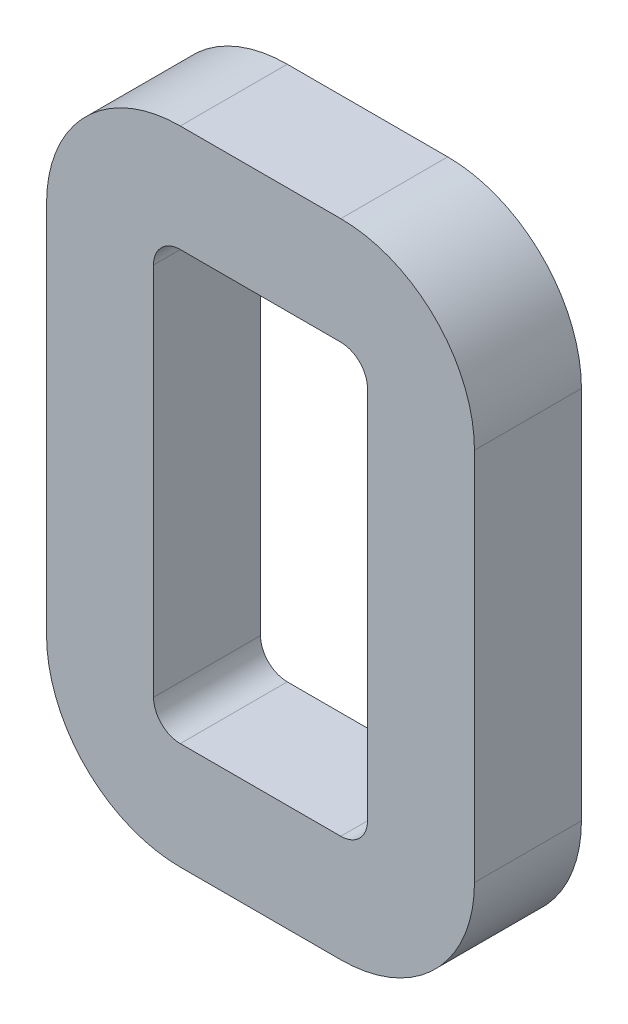
ISO-10303-21;
HEADER;
FILE_DESCRIPTION(('STEP AP214'),'2;1');
FILE_NAME('part.step','',(''),(''),'','','');
FILE_SCHEMA(('AUTOMOTIVE_DESIGN { 1 0 10303 214 1 1 1 1 }'));
ENDSEC;
DATA;
#1=APPLICATION_CONTEXT('core data for automotive mechanical design processes');
#2=APPLICATION_PROTOCOL_DEFINITION('international standard','automotive_design',2000,#1);
#3=PRODUCT_CONTEXT('',#1,'mechanical');
#4=PRODUCT('Part','Part','',(#3));
#5=PRODUCT_RELATED_PRODUCT_CATEGORY('part','',(#4));
#6=PRODUCT_DEFINITION_FORMATION('','',#4);
#7=PRODUCT_DEFINITION_CONTEXT('part definition',#1,'design');
#8=PRODUCT_DEFINITION('design','',#6,#7);
#9=PRODUCT_DEFINITION_SHAPE('','',#8);
#10=(LENGTH_UNIT() NAMED_UNIT(*) SI_UNIT(.MILLI.,.METRE.));
#11=(NAMED_UNIT(*) PLANE_ANGLE_UNIT() SI_UNIT($,.RADIAN.));
#12=(NAMED_UNIT(*) SI_UNIT($,.STERADIAN.) SOLID_ANGLE_UNIT());
#13=UNCERTAINTY_MEASURE_WITH_UNIT(LENGTH_MEASURE(1.E-05),#10,'distance_accuracy_value','');
#14=(GEOMETRIC_REPRESENTATION_CONTEXT(3) GLOBAL_UNCERTAINTY_ASSIGNED_CONTEXT((#13)) GLOBAL_UNIT_ASSIGNED_CONTEXT((#10,
#11,#12)) REPRESENTATION_CONTEXT('',''));
#15=CARTESIAN_POINT('',(0.,0.,0.));
#16=DIRECTION('',(0.,0.,1.));
#17=DIRECTION('',(1.,0.,0.));
#18=AXIS2_PLACEMENT_3D('',#15,#16,#17);
#19=CARTESIAN_POINT('',(3.175,3.175,12.7));
#20=DIRECTION('',(0.,0.,1.));
#21=DIRECTION('',(1.,0.,0.));
#22=AXIS2_PLACEMENT_3D('',#19,#20,#21);
#23=PLANE('',#22);
#24=CARTESIAN_POINT('',(3.175,3.175,12.7));
#25=DIRECTION('',(0.,0.,1.));
#26=DIRECTION('',(1.,0.,0.));
#27=AXIS2_PLACEMENT_3D('',#24,#25,#26);
#28=CIRCLE('',#27,15.875);
#29=CARTESIAN_POINT('',(-12.7,3.17500000000002,12.7));
#30=VERTEX_POINT('',#29);
#31=CARTESIAN_POINT('',(3.17500000000002,-12.7,12.7));
#32=VERTEX_POINT('',#31);
#33=EDGE_CURVE('E246',#30,#32,#28,.T.);
#34=ORIENTED_EDGE('',*,*,#33,.T.);
#35=DIRECTION('',(1.,0.,0.));
#36=VECTOR('',#35,1.);
#37=CARTESIAN_POINT('',(3.17500000000002,-12.7,12.7));
#38=LINE('',#37,#36);
#39=CARTESIAN_POINT('',(22.2249999999999,-12.7,12.7));
#40=VERTEX_POINT('',#39);
#41=EDGE_CURVE('E250',#32,#40,#38,.T.);
#42=ORIENTED_EDGE('',*,*,#41,.T.);
#43=CARTESIAN_POINT('',(22.225,3.175,12.7));
#44=DIRECTION('',(0.,0.,1.));
#45=DIRECTION('',(1.,0.,0.));
#46=AXIS2_PLACEMENT_3D('',#43,#44,#45);
#47=CIRCLE('',#46,15.875);
#48=CARTESIAN_POINT('',(38.1,3.17500000000002,12.7));
#49=VERTEX_POINT('',#48);
#50=EDGE_CURVE('E254',#40,#49,#47,.T.);
#51=ORIENTED_EDGE('',*,*,#50,.T.);
#52=DIRECTION('',(0.,1.,0.));
#53=VECTOR('',#52,1.);
#54=CARTESIAN_POINT('',(38.1,3.17500000000002,12.7));
#55=LINE('',#54,#53);
#56=CARTESIAN_POINT('',(38.1,47.6249999999999,12.7));
#57=VERTEX_POINT('',#56);
#58=EDGE_CURVE('E257',#49,#57,#55,.T.);
#59=ORIENTED_EDGE('',*,*,#58,.T.);
#60=CARTESIAN_POINT('',(22.225,47.625,12.7));
#61=DIRECTION('',(0.,0.,1.));
#62=DIRECTION('',(-1.,0.,0.));
#63=AXIS2_PLACEMENT_3D('',#60,#61,#62);
#64=CIRCLE('',#63,15.875);
#65=CARTESIAN_POINT('',(22.225,63.5,12.7));
#66=VERTEX_POINT('',#65);
#67=EDGE_CURVE('E260',#57,#66,#64,.T.);
#68=ORIENTED_EDGE('',*,*,#67,.T.);
#69=DIRECTION('',(-1.,0.,0.));
#70=VECTOR('',#69,1.);
#71=CARTESIAN_POINT('',(3.17500000000012,63.5,12.7));
#72=LINE('',#71,#70);
#73=CARTESIAN_POINT('',(3.17500000000012,63.5,12.7));
#74=VERTEX_POINT('',#73);
#75=EDGE_CURVE('E263',#66,#74,#72,.T.);
#76=ORIENTED_EDGE('',*,*,#75,.T.);
#77=CARTESIAN_POINT('',(3.175,47.625,12.7));
#78=DIRECTION('',(0.,0.,1.));
#79=DIRECTION('',(1.,0.,0.));
#80=AXIS2_PLACEMENT_3D('',#77,#78,#79);
#81=CIRCLE('',#80,15.875);
#82=CARTESIAN_POINT('',(-12.7,47.625,12.7));
#83=VERTEX_POINT('',#82);
#84=EDGE_CURVE('E266',#74,#83,#81,.T.);
#85=ORIENTED_EDGE('',*,*,#84,.T.);
#86=DIRECTION('',(0.,-1.,0.));
#87=VECTOR('',#86,1.);
#88=CARTESIAN_POINT('',(-12.7,3.17500000000002,12.7));
#89=LINE('',#88,#87);
#90=EDGE_CURVE('E269',#83,#30,#89,.T.);
#91=ORIENTED_EDGE('',*,*,#90,.T.);
#92=EDGE_LOOP('',(#34,#42,#51,#59,#68,#76,#85,#91));
#93=FACE_BOUND('',#92,.T.);
#94=DIRECTION('',(1.,0.,0.));
#95=VECTOR('',#94,1.);
#96=CARTESIAN_POINT('',(3.17500000000002,0.,12.7));
#97=LINE('',#96,#95);
#98=CARTESIAN_POINT('',(3.17500000000002,0.,12.7));
#99=VERTEX_POINT('',#98);
#100=CARTESIAN_POINT('',(22.225,0.,12.7));
#101=VERTEX_POINT('',#100);
#102=EDGE_CURVE('E166',#99,#101,#97,.T.);
#103=ORIENTED_EDGE('',*,*,#102,.F.);
#104=CARTESIAN_POINT('',(3.175,3.175,12.7));
#105=DIRECTION('',(0.,0.,1.));
#106=DIRECTION('',(1.,0.,0.));
#107=AXIS2_PLACEMENT_3D('',#104,#105,#106);
#108=CIRCLE('',#107,3.175);
#109=CARTESIAN_POINT('',(0.,3.17500000000002,12.7));
#110=VERTEX_POINT('',#109);
#111=EDGE_CURVE('E157',#110,#99,#108,.T.);
#112=ORIENTED_EDGE('',*,*,#111,.F.);
#113=DIRECTION('',(0.,-1.,0.));
#114=VECTOR('',#113,1.);
#115=CARTESIAN_POINT('',(0.,3.17500000000002,12.7));
#116=LINE('',#115,#114);
#117=CARTESIAN_POINT('',(0.,47.625,12.7));
#118=VERTEX_POINT('',#117);
#119=EDGE_CURVE('E198',#118,#110,#116,.T.);
#120=ORIENTED_EDGE('',*,*,#119,.F.);
#121=CARTESIAN_POINT('',(3.175,47.625,12.7));
#122=DIRECTION('',(0.,0.,1.));
#123=DIRECTION('',(1.,0.,0.));
#124=AXIS2_PLACEMENT_3D('',#121,#122,#123);
#125=CIRCLE('',#124,3.175);
#126=CARTESIAN_POINT('',(3.17500000000002,50.8,12.7));
#127=VERTEX_POINT('',#126);
#128=EDGE_CURVE('E195',#127,#118,#125,.T.);
#129=ORIENTED_EDGE('',*,*,#128,.F.);
#130=DIRECTION('',(-1.,0.,0.));
#131=VECTOR('',#130,1.);
#132=CARTESIAN_POINT('',(3.17500000000002,50.8,12.7));
#133=LINE('',#132,#131);
#134=CARTESIAN_POINT('',(22.225,50.8,12.7));
#135=VERTEX_POINT('',#134);
#136=EDGE_CURVE('E192',#135,#127,#133,.T.);
#137=ORIENTED_EDGE('',*,*,#136,.F.);
#138=CARTESIAN_POINT('',(22.225,47.625,12.7));
#139=DIRECTION('',(0.,0.,1.));
#140=DIRECTION('',(-1.,0.,0.));
#141=AXIS2_PLACEMENT_3D('',#138,#139,#140);
#142=CIRCLE('',#141,3.175);
#143=CARTESIAN_POINT('',(25.4,47.625,12.7));
#144=VERTEX_POINT('',#143);
#145=EDGE_CURVE('E189',#144,#135,#142,.T.);
#146=ORIENTED_EDGE('',*,*,#145,.F.);
#147=DIRECTION('',(0.,1.,0.));
#148=VECTOR('',#147,1.);
#149=CARTESIAN_POINT('',(25.4,3.17500000000002,12.7));
#150=LINE('',#149,#148);
#151=CARTESIAN_POINT('',(25.4,3.17500000000002,12.7));
#152=VERTEX_POINT('',#151);
#153=EDGE_CURVE('E184',#152,#144,#150,.T.);
#154=ORIENTED_EDGE('',*,*,#153,.F.);
#155=CARTESIAN_POINT('',(22.225,3.175,12.7));
#156=DIRECTION('',(0.,0.,1.));
#157=DIRECTION('',(1.,0.,0.));
#158=AXIS2_PLACEMENT_3D('',#155,#156,#157);
#159=CIRCLE('',#158,3.175);
#160=EDGE_CURVE('E180',#101,#152,#159,.T.);
#161=ORIENTED_EDGE('',*,*,#160,.F.);
#162=EDGE_LOOP('',(#103,#112,#120,#129,#137,#146,#154,#161));
#163=FACE_BOUND('',#162,.T.);
#164=ADVANCED_FACE('F43',(#93,#163),#23,.T.);
#165=CARTESIAN_POINT('',(3.175,3.175,0.));
#166=DIRECTION('',(0.,0.,1.));
#167=DIRECTION('',(1.,0.,0.));
#168=AXIS2_PLACEMENT_3D('',#165,#166,#167);
#169=PLANE('',#168);
#170=CARTESIAN_POINT('',(3.175,3.175,0.));
#171=DIRECTION('',(0.,0.,1.));
#172=DIRECTION('',(1.,0.,0.));
#173=AXIS2_PLACEMENT_3D('',#170,#171,#172);
#174=CIRCLE('',#173,15.875);
#175=CARTESIAN_POINT('',(-12.7,3.17500000000002,0.));
#176=VERTEX_POINT('',#175);
#177=CARTESIAN_POINT('',(3.17500000000002,-12.7,0.));
#178=VERTEX_POINT('',#177);
#179=EDGE_CURVE('E175',#176,#178,#174,.T.);
#180=ORIENTED_EDGE('',*,*,#179,.F.);
#181=DIRECTION('',(0.,-1.,0.));
#182=VECTOR('',#181,1.);
#183=CARTESIAN_POINT('',(-12.7,3.17500000000002,0.));
#184=LINE('',#183,#182);
#185=CARTESIAN_POINT('',(-12.7,47.625,0.));
#186=VERTEX_POINT('',#185);
#187=EDGE_CURVE('E251',#186,#176,#184,.T.);
#188=ORIENTED_EDGE('',*,*,#187,.F.);
#189=CARTESIAN_POINT('',(3.175,47.625,0.));
#190=DIRECTION('',(0.,0.,1.));
#191=DIRECTION('',(1.,0.,0.));
#192=AXIS2_PLACEMENT_3D('',#189,#190,#191);
#193=CIRCLE('',#192,15.875);
#194=CARTESIAN_POINT('',(3.17500000000012,63.5,0.));
#195=VERTEX_POINT('',#194);
#196=EDGE_CURVE('E291',#195,#186,#193,.T.);
#197=ORIENTED_EDGE('',*,*,#196,.F.);
#198=DIRECTION('',(-1.,0.,0.));
#199=VECTOR('',#198,1.);
#200=CARTESIAN_POINT('',(3.17500000000012,63.5,0.));
#201=LINE('',#200,#199);
#202=CARTESIAN_POINT('',(22.225,63.5,0.));
#203=VERTEX_POINT('',#202);
#204=EDGE_CURVE('E288',#203,#195,#201,.T.);
#205=ORIENTED_EDGE('',*,*,#204,.F.);
#206=CARTESIAN_POINT('',(22.225,47.625,0.));
#207=DIRECTION('',(0.,0.,1.));
#208=DIRECTION('',(-1.,0.,0.));
#209=AXIS2_PLACEMENT_3D('',#206,#207,#208);
#210=CIRCLE('',#209,15.875);
#211=CARTESIAN_POINT('',(38.1,47.6249999999999,0.));
#212=VERTEX_POINT('',#211);
#213=EDGE_CURVE('E285',#212,#203,#210,.T.);
#214=ORIENTED_EDGE('',*,*,#213,.F.);
#215=DIRECTION('',(0.,1.,0.));
#216=VECTOR('',#215,1.);
#217=CARTESIAN_POINT('',(38.1,3.17500000000002,0.));
#218=LINE('',#217,#216);
#219=CARTESIAN_POINT('',(38.1,3.17500000000002,0.));
#220=VERTEX_POINT('',#219);
#221=EDGE_CURVE('E282',#220,#212,#218,.T.);
#222=ORIENTED_EDGE('',*,*,#221,.F.);
#223=CARTESIAN_POINT('',(22.225,3.175,0.));
#224=DIRECTION('',(0.,0.,1.));
#225=DIRECTION('',(1.,0.,0.));
#226=AXIS2_PLACEMENT_3D('',#223,#224,#225);
#227=CIRCLE('',#226,15.875);
#228=CARTESIAN_POINT('',(22.2249999999999,-12.7,0.));
#229=VERTEX_POINT('',#228);
#230=EDGE_CURVE('E279',#229,#220,#227,.T.);
#231=ORIENTED_EDGE('',*,*,#230,.F.);
#232=DIRECTION('',(1.,0.,0.));
#233=VECTOR('',#232,1.);
#234=CARTESIAN_POINT('',(3.17500000000002,-12.7,0.));
#235=LINE('',#234,#233);
#236=EDGE_CURVE('E276',#178,#229,#235,.T.);
#237=ORIENTED_EDGE('',*,*,#236,.F.);
#238=EDGE_LOOP('',(#180,#188,#197,#205,#214,#222,#231,#237));
#239=FACE_BOUND('',#238,.T.);
#240=CARTESIAN_POINT('',(3.175,3.175,0.));
#241=DIRECTION('',(0.,0.,1.));
#242=DIRECTION('',(1.,0.,0.));
#243=AXIS2_PLACEMENT_3D('',#240,#241,#242);
#244=CIRCLE('',#243,3.175);
#245=CARTESIAN_POINT('',(0.,3.17500000000002,0.));
#246=VERTEX_POINT('',#245);
#247=CARTESIAN_POINT('',(3.17500000000002,0.,0.));
#248=VERTEX_POINT('',#247);
#249=EDGE_CURVE('E67',#246,#248,#244,.T.);
#250=ORIENTED_EDGE('',*,*,#249,.T.);
#251=DIRECTION('',(1.,0.,0.));
#252=VECTOR('',#251,1.);
#253=CARTESIAN_POINT('',(3.17500000000002,0.,0.));
#254=LINE('',#253,#252);
#255=CARTESIAN_POINT('',(22.225,0.,0.));
#256=VERTEX_POINT('',#255);
#257=EDGE_CURVE('E173',#248,#256,#254,.T.);
#258=ORIENTED_EDGE('',*,*,#257,.T.);
#259=CARTESIAN_POINT('',(22.225,3.175,0.));
#260=DIRECTION('',(0.,0.,1.));
#261=DIRECTION('',(1.,0.,0.));
#262=AXIS2_PLACEMENT_3D('',#259,#260,#261);
#263=CIRCLE('',#262,3.175);
#264=CARTESIAN_POINT('',(25.4,3.17500000000002,0.));
#265=VERTEX_POINT('',#264);
#266=EDGE_CURVE('E205',#256,#265,#263,.T.);
#267=ORIENTED_EDGE('',*,*,#266,.T.);
#268=DIRECTION('',(0.,1.,0.));
#269=VECTOR('',#268,1.);
#270=CARTESIAN_POINT('',(25.4,3.17500000000002,0.));
#271=LINE('',#270,#269);
#272=CARTESIAN_POINT('',(25.4,47.625,0.));
#273=VERTEX_POINT('',#272);
#274=EDGE_CURVE('E209',#265,#273,#271,.T.);
#275=ORIENTED_EDGE('',*,*,#274,.T.);
#276=CARTESIAN_POINT('',(22.225,47.625,0.));
#277=DIRECTION('',(0.,0.,1.));
#278=DIRECTION('',(-1.,0.,0.));
#279=AXIS2_PLACEMENT_3D('',#276,#277,#278);
#280=CIRCLE('',#279,3.175);
#281=CARTESIAN_POINT('',(22.225,50.8,0.));
#282=VERTEX_POINT('',#281);
#283=EDGE_CURVE('E213',#273,#282,#280,.T.);
#284=ORIENTED_EDGE('',*,*,#283,.T.);
#285=DIRECTION('',(-1.,0.,0.));
#286=VECTOR('',#285,1.);
#287=CARTESIAN_POINT('',(3.17500000000002,50.8,0.));
#288=LINE('',#287,#286);
#289=CARTESIAN_POINT('',(3.17500000000002,50.8,0.));
#290=VERTEX_POINT('',#289);
#291=EDGE_CURVE('E217',#282,#290,#288,.T.);
#292=ORIENTED_EDGE('',*,*,#291,.T.);
#293=CARTESIAN_POINT('',(3.175,47.625,0.));
#294=DIRECTION('',(0.,0.,1.));
#295=DIRECTION('',(1.,0.,0.));
#296=AXIS2_PLACEMENT_3D('',#293,#294,#295);
#297=CIRCLE('',#296,3.175);
#298=CARTESIAN_POINT('',(0.,47.625,0.));
#299=VERTEX_POINT('',#298);
#300=EDGE_CURVE('E221',#290,#299,#297,.T.);
#301=ORIENTED_EDGE('',*,*,#300,.T.);
#302=DIRECTION('',(0.,-1.,0.));
#303=VECTOR('',#302,1.);
#304=CARTESIAN_POINT('',(0.,3.17500000000002,0.));
#305=LINE('',#304,#303);
#306=EDGE_CURVE('E167',#299,#246,#305,.T.);
#307=ORIENTED_EDGE('',*,*,#306,.T.);
#308=EDGE_LOOP('',(#250,#258,#267,#275,#284,#292,#301,#307));
#309=FACE_BOUND('',#308,.T.);
#310=ADVANCED_FACE('F330',(#239,#309),#169,.F.);
#311=CARTESIAN_POINT('',(3.175,3.175,12.7));
#312=DIRECTION('',(0.,0.,-1.));
#313=DIRECTION('',(-1.,0.,0.));
#314=AXIS2_PLACEMENT_3D('',#311,#312,#313);
#315=CYLINDRICAL_SURFACE('',#314,15.875);
#316=ORIENTED_EDGE('',*,*,#179,.T.);
#317=DIRECTION('',(0.,0.,-1.));
#318=VECTOR('',#317,1.);
#319=CARTESIAN_POINT('',(3.17500000000002,-12.7,12.7));
#320=LINE('',#319,#318);
#321=EDGE_CURVE('E11',#32,#178,#320,.T.);
#322=ORIENTED_EDGE('',*,*,#321,.F.);
#323=ORIENTED_EDGE('',*,*,#33,.F.);
#324=DIRECTION('',(0.,0.,-1.));
#325=VECTOR('',#324,1.);
#326=CARTESIAN_POINT('',(-12.7,3.17500000000002,12.7));
#327=LINE('',#326,#325);
#328=EDGE_CURVE('E272',#30,#176,#327,.T.);
#329=ORIENTED_EDGE('',*,*,#328,.T.);
#330=EDGE_LOOP('',(#316,#322,#323,#329));
#331=FACE_BOUND('',#330,.T.);
#332=ADVANCED_FACE('F45',(#331),#315,.T.);
#333=CARTESIAN_POINT('',(3.17500000000002,-12.7,12.7));
#334=DIRECTION('',(0.,1.,0.));
#335=DIRECTION('',(-1.,0.,0.));
#336=AXIS2_PLACEMENT_3D('',#333,#334,#335);
#337=PLANE('',#336);
#338=ORIENTED_EDGE('',*,*,#236,.T.);
#339=DIRECTION('',(0.,0.,-1.));
#340=VECTOR('',#339,1.);
#341=CARTESIAN_POINT('',(22.2249999999999,-12.7,12.7));
#342=LINE('',#341,#340);
#343=EDGE_CURVE('E52',#40,#229,#342,.T.);
#344=ORIENTED_EDGE('',*,*,#343,.F.);
#345=ORIENTED_EDGE('',*,*,#41,.F.);
#346=ORIENTED_EDGE('',*,*,#321,.T.);
#347=EDGE_LOOP('',(#338,#344,#345,#346));
#348=FACE_BOUND('',#347,.T.);
#349=ADVANCED_FACE('F347',(#348),#337,.F.);
#350=CARTESIAN_POINT('',(22.225,3.175,12.7));
#351=DIRECTION('',(0.,0.,-1.));
#352=DIRECTION('',(-1.,0.,0.));
#353=AXIS2_PLACEMENT_3D('',#350,#351,#352);
#354=CYLINDRICAL_SURFACE('',#353,15.875);
#355=ORIENTED_EDGE('',*,*,#230,.T.);
#356=DIRECTION('',(0.,0.,-1.));
#357=VECTOR('',#356,1.);
#358=CARTESIAN_POINT('',(38.1,3.17500000000002,12.7));
#359=LINE('',#358,#357);
#360=EDGE_CURVE('E315',#49,#220,#359,.T.);
#361=ORIENTED_EDGE('',*,*,#360,.F.);
#362=ORIENTED_EDGE('',*,*,#50,.F.);
#363=ORIENTED_EDGE('',*,*,#343,.T.);
#364=EDGE_LOOP('',(#355,#361,#362,#363));
#365=FACE_BOUND('',#364,.T.);
#366=ADVANCED_FACE('F324',(#365),#354,.T.);
#367=CARTESIAN_POINT('',(38.1,3.17500000000002,12.7));
#368=DIRECTION('',(-1.,0.,0.));
#369=DIRECTION('',(0.,0.,1.));
#370=AXIS2_PLACEMENT_3D('',#367,#368,#369);
#371=PLANE('',#370);
#372=ORIENTED_EDGE('',*,*,#221,.T.);
#373=DIRECTION('',(0.,0.,-1.));
#374=VECTOR('',#373,1.);
#375=CARTESIAN_POINT('',(38.1,47.6249999999999,12.7));
#376=LINE('',#375,#374);
#377=EDGE_CURVE('E311',#57,#212,#376,.T.);
#378=ORIENTED_EDGE('',*,*,#377,.F.);
#379=ORIENTED_EDGE('',*,*,#58,.F.);
#380=ORIENTED_EDGE('',*,*,#360,.T.);
#381=EDGE_LOOP('',(#372,#378,#379,#380));
#382=FACE_BOUND('',#381,.T.);
#383=ADVANCED_FACE('F336',(#382),#371,.F.);
#384=CARTESIAN_POINT('',(22.225,47.625,12.7));
#385=DIRECTION('',(0.,0.,-1.));
#386=DIRECTION('',(-1.,0.,0.));
#387=AXIS2_PLACEMENT_3D('',#384,#385,#386);
#388=CYLINDRICAL_SURFACE('',#387,15.875);
#389=ORIENTED_EDGE('',*,*,#213,.T.);
#390=DIRECTION('',(0.,0.,-1.));
#391=VECTOR('',#390,1.);
#392=CARTESIAN_POINT('',(22.225,63.5,12.7));
#393=LINE('',#392,#391);
#394=EDGE_CURVE('E307',#66,#203,#393,.T.);
#395=ORIENTED_EDGE('',*,*,#394,.F.);
#396=ORIENTED_EDGE('',*,*,#67,.F.);
#397=ORIENTED_EDGE('',*,*,#377,.T.);
#398=EDGE_LOOP('',(#389,#395,#396,#397));
#399=FACE_BOUND('',#398,.T.);
#400=ADVANCED_FACE('F340',(#399),#388,.T.);
#401=CARTESIAN_POINT('',(3.17500000000012,63.5,12.7));
#402=DIRECTION('',(0.,-1.,0.));
#403=DIRECTION('',(0.,0.,-1.));
#404=AXIS2_PLACEMENT_3D('',#401,#402,#403);
#405=PLANE('',#404);
#406=ORIENTED_EDGE('',*,*,#204,.T.);
#407=DIRECTION('',(0.,0.,-1.));
#408=VECTOR('',#407,1.);
#409=CARTESIAN_POINT('',(3.17500000000012,63.5,12.7));
#410=LINE('',#409,#408);
#411=EDGE_CURVE('E303',#74,#195,#410,.T.);
#412=ORIENTED_EDGE('',*,*,#411,.F.);
#413=ORIENTED_EDGE('',*,*,#75,.F.);
#414=ORIENTED_EDGE('',*,*,#394,.T.);
#415=EDGE_LOOP('',(#406,#412,#413,#414));
#416=FACE_BOUND('',#415,.T.);
#417=ADVANCED_FACE('F360',(#416),#405,.F.);
#418=CARTESIAN_POINT('',(3.175,47.625,12.7));
#419=DIRECTION('',(0.,0.,-1.));
#420=DIRECTION('',(-1.,0.,0.));
#421=AXIS2_PLACEMENT_3D('',#418,#419,#420);
#422=CYLINDRICAL_SURFACE('',#421,15.875);
#423=ORIENTED_EDGE('',*,*,#196,.T.);
#424=DIRECTION('',(0.,0.,-1.));
#425=VECTOR('',#424,1.);
#426=CARTESIAN_POINT('',(-12.7,47.625,12.7));
#427=LINE('',#426,#425);
#428=EDGE_CURVE('E299',#83,#186,#427,.T.);
#429=ORIENTED_EDGE('',*,*,#428,.F.);
#430=ORIENTED_EDGE('',*,*,#84,.F.);
#431=ORIENTED_EDGE('',*,*,#411,.T.);
#432=EDGE_LOOP('',(#423,#429,#430,#431));
#433=FACE_BOUND('',#432,.T.);
#434=ADVANCED_FACE('F358',(#433),#422,.T.);
#435=CARTESIAN_POINT('',(-12.7,3.17500000000002,12.7));
#436=DIRECTION('',(1.,0.,0.));
#437=DIRECTION('',(0.,0.,-1.));
#438=AXIS2_PLACEMENT_3D('',#435,#436,#437);
#439=PLANE('',#438);
#440=ORIENTED_EDGE('',*,*,#187,.T.);
#441=ORIENTED_EDGE('',*,*,#328,.F.);
#442=ORIENTED_EDGE('',*,*,#90,.F.);
#443=ORIENTED_EDGE('',*,*,#428,.T.);
#444=EDGE_LOOP('',(#440,#441,#442,#443));
#445=FACE_BOUND('',#444,.T.);
#446=ADVANCED_FACE('F353',(#445),#439,.F.);
#447=CARTESIAN_POINT('',(3.175,3.175,12.7));
#448=DIRECTION('',(0.,0.,-1.));
#449=DIRECTION('',(-1.,0.,0.));
#450=AXIS2_PLACEMENT_3D('',#447,#448,#449);
#451=CYLINDRICAL_SURFACE('',#450,3.175);
#452=ORIENTED_EDGE('',*,*,#249,.F.);
#453=DIRECTION('',(0.,0.,-1.));
#454=VECTOR('',#453,1.);
#455=CARTESIAN_POINT('',(0.,3.17500000000002,12.7));
#456=LINE('',#455,#454);
#457=EDGE_CURVE('E161',#110,#246,#456,.T.);
#458=ORIENTED_EDGE('',*,*,#457,.F.);
#459=ORIENTED_EDGE('',*,*,#111,.T.);
#460=DIRECTION('',(0.,0.,-1.));
#461=VECTOR('',#460,1.);
#462=CARTESIAN_POINT('',(3.17500000000002,0.,12.7));
#463=LINE('',#462,#461);
#464=EDGE_CURVE('E160',#99,#248,#463,.T.);
#465=ORIENTED_EDGE('',*,*,#464,.T.);
#466=EDGE_LOOP('',(#452,#458,#459,#465));
#467=FACE_BOUND('',#466,.T.);
#468=ADVANCED_FACE('F159',(#467),#451,.F.);
#469=CARTESIAN_POINT('',(3.17500000000002,0.,12.7));
#470=DIRECTION('',(0.,1.,0.));
#471=DIRECTION('',(0.,0.,1.));
#472=AXIS2_PLACEMENT_3D('',#469,#470,#471);
#473=PLANE('',#472);
#474=ORIENTED_EDGE('',*,*,#257,.F.);
#475=ORIENTED_EDGE('',*,*,#464,.F.);
#476=ORIENTED_EDGE('',*,*,#102,.T.);
#477=DIRECTION('',(0.,0.,-1.));
#478=VECTOR('',#477,1.);
#479=CARTESIAN_POINT('',(22.225,0.,12.7));
#480=LINE('',#479,#478);
#481=EDGE_CURVE('E176',#101,#256,#480,.T.);
#482=ORIENTED_EDGE('',*,*,#481,.T.);
#483=EDGE_LOOP('',(#474,#475,#476,#482));
#484=FACE_BOUND('',#483,.T.);
#485=ADVANCED_FACE('F170',(#484),#473,.T.);
#486=CARTESIAN_POINT('',(22.225,3.175,12.7));
#487=DIRECTION('',(0.,0.,-1.));
#488=DIRECTION('',(-1.,0.,0.));
#489=AXIS2_PLACEMENT_3D('',#486,#487,#488);
#490=CYLINDRICAL_SURFACE('',#489,3.175);
#491=ORIENTED_EDGE('',*,*,#266,.F.);
#492=ORIENTED_EDGE('',*,*,#481,.F.);
#493=ORIENTED_EDGE('',*,*,#160,.T.);
#494=DIRECTION('',(0.,0.,-1.));
#495=VECTOR('',#494,1.);
#496=CARTESIAN_POINT('',(25.4,3.17500000000002,12.7));
#497=LINE('',#496,#495);
#498=EDGE_CURVE('E241',#152,#265,#497,.T.);
#499=ORIENTED_EDGE('',*,*,#498,.T.);
#500=EDGE_LOOP('',(#491,#492,#493,#499));
#501=FACE_BOUND('',#500,.T.);
#502=ADVANCED_FACE('F385',(#501),#490,.F.);
#503=CARTESIAN_POINT('',(25.4,3.17500000000002,12.7));
#504=DIRECTION('',(-1.,0.,0.));
#505=DIRECTION('',(0.,0.,1.));
#506=AXIS2_PLACEMENT_3D('',#503,#504,#505);
#507=PLANE('',#506);
#508=ORIENTED_EDGE('',*,*,#274,.F.);
#509=ORIENTED_EDGE('',*,*,#498,.F.);
#510=ORIENTED_EDGE('',*,*,#153,.T.);
#511=DIRECTION('',(0.,0.,-1.));
#512=VECTOR('',#511,1.);
#513=CARTESIAN_POINT('',(25.4,47.625,12.7));
#514=LINE('',#513,#512);
#515=EDGE_CURVE('E238',#144,#273,#514,.T.);
#516=ORIENTED_EDGE('',*,*,#515,.T.);
#517=EDGE_LOOP('',(#508,#509,#510,#516));
#518=FACE_BOUND('',#517,.T.);
#519=ADVANCED_FACE('F389',(#518),#507,.T.);
#520=CARTESIAN_POINT('',(22.225,47.625,12.7));
#521=DIRECTION('',(0.,0.,-1.));
#522=DIRECTION('',(-1.,0.,0.));
#523=AXIS2_PLACEMENT_3D('',#520,#521,#522);
#524=CYLINDRICAL_SURFACE('',#523,3.175);
#525=ORIENTED_EDGE('',*,*,#283,.F.);
#526=ORIENTED_EDGE('',*,*,#515,.F.);
#527=ORIENTED_EDGE('',*,*,#145,.T.);
#528=DIRECTION('',(0.,0.,-1.));
#529=VECTOR('',#528,1.);
#530=CARTESIAN_POINT('',(22.225,50.8,12.7));
#531=LINE('',#530,#529);
#532=EDGE_CURVE('E235',#135,#282,#531,.T.);
#533=ORIENTED_EDGE('',*,*,#532,.T.);
#534=EDGE_LOOP('',(#525,#526,#527,#533));
#535=FACE_BOUND('',#534,.T.);
#536=ADVANCED_FACE('F395',(#535),#524,.F.);
#537=CARTESIAN_POINT('',(3.17500000000002,50.8,12.7));
#538=DIRECTION('',(0.,-1.,0.));
#539=DIRECTION('',(0.,0.,-1.));
#540=AXIS2_PLACEMENT_3D('',#537,#538,#539);
#541=PLANE('',#540);
#542=ORIENTED_EDGE('',*,*,#291,.F.);
#543=ORIENTED_EDGE('',*,*,#532,.F.);
#544=ORIENTED_EDGE('',*,*,#136,.T.);
#545=DIRECTION('',(0.,0.,-1.));
#546=VECTOR('',#545,1.);
#547=CARTESIAN_POINT('',(3.17500000000002,50.8,12.7));
#548=LINE('',#547,#546);
#549=EDGE_CURVE('E232',#127,#290,#548,.T.);
#550=ORIENTED_EDGE('',*,*,#549,.T.);
#551=EDGE_LOOP('',(#542,#543,#544,#550));
#552=FACE_BOUND('',#551,.T.);
#553=ADVANCED_FACE('F399',(#552),#541,.T.);
#554=CARTESIAN_POINT('',(3.175,47.625,12.7));
#555=DIRECTION('',(0.,0.,-1.));
#556=DIRECTION('',(-1.,0.,0.));
#557=AXIS2_PLACEMENT_3D('',#554,#555,#556);
#558=CYLINDRICAL_SURFACE('',#557,3.175);
#559=ORIENTED_EDGE('',*,*,#300,.F.);
#560=ORIENTED_EDGE('',*,*,#549,.F.);
#561=ORIENTED_EDGE('',*,*,#128,.T.);
#562=DIRECTION('',(0.,0.,-1.));
#563=VECTOR('',#562,1.);
#564=CARTESIAN_POINT('',(0.,47.625,12.7));
#565=LINE('',#564,#563);
#566=EDGE_CURVE('E59',#118,#299,#565,.T.);
#567=ORIENTED_EDGE('',*,*,#566,.T.);
#568=EDGE_LOOP('',(#559,#560,#561,#567));
#569=FACE_BOUND('',#568,.T.);
#570=ADVANCED_FACE('F403',(#569),#558,.F.);
#571=CARTESIAN_POINT('',(0.,3.17500000000002,12.7));
#572=DIRECTION('',(1.,0.,0.));
#573=DIRECTION('',(0.,0.,-1.));
#574=AXIS2_PLACEMENT_3D('',#571,#572,#573);
#575=PLANE('',#574);
#576=ORIENTED_EDGE('',*,*,#306,.F.);
#577=ORIENTED_EDGE('',*,*,#566,.F.);
#578=ORIENTED_EDGE('',*,*,#119,.T.);
#579=ORIENTED_EDGE('',*,*,#457,.T.);
#580=EDGE_LOOP('',(#576,#577,#578,#579));
#581=FACE_BOUND('',#580,.T.);
#582=ADVANCED_FACE('F407',(#581),#575,.T.);
#583=CLOSED_SHELL('',(#164,#310,#332,#349,#366,#383,#400,#417,#434,#446,#468,#485,#502,#519,
#536,#553,#570,#582));
#584=MANIFOLD_SOLID_BREP('B2',#583);
#585=ADVANCED_BREP_SHAPE_REPRESENTATION('',(#18,#584),#14);
#586=SHAPE_DEFINITION_REPRESENTATION(#9,#585);
ENDSEC;
END-ISO-10303-21;
